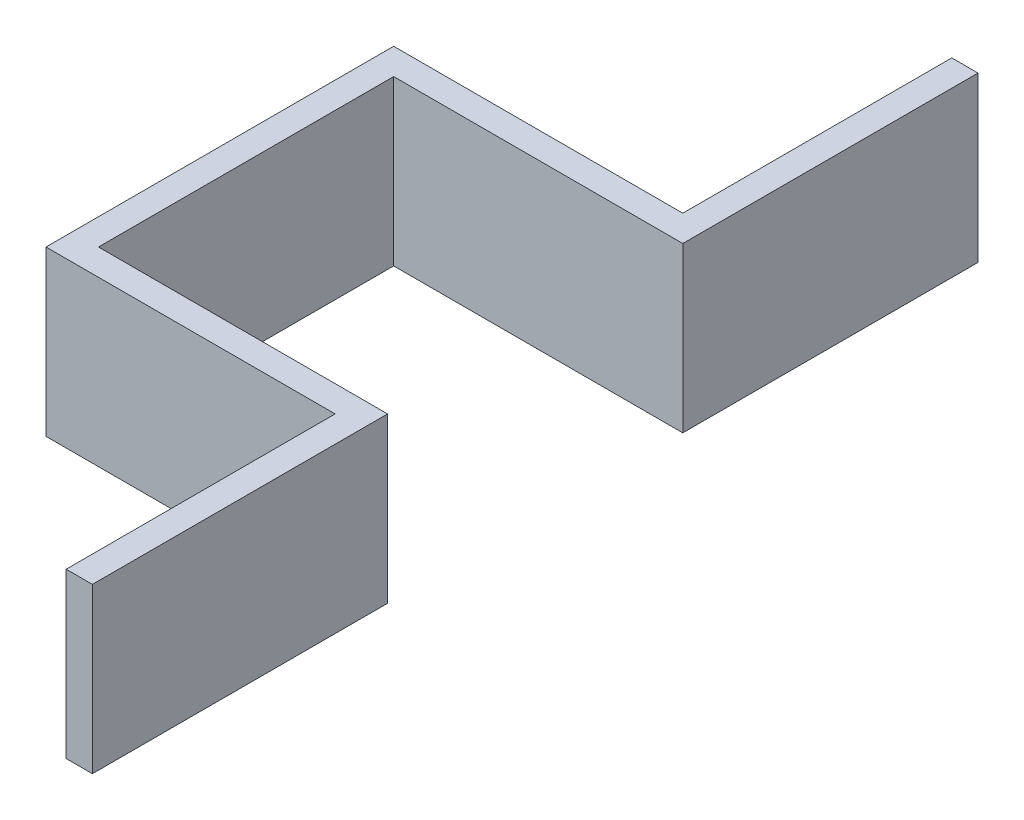
ISO-10303-21;
HEADER;
FILE_DESCRIPTION(('STEP AP214'),'2;1');
FILE_NAME('part.step','',(''),(''),'','','');
FILE_SCHEMA(('AUTOMOTIVE_DESIGN { 1 0 10303 214 1 1 1 1 }'));
ENDSEC;
DATA;
#1=APPLICATION_CONTEXT('core data for automotive mechanical design processes');
#2=APPLICATION_PROTOCOL_DEFINITION('international standard','automotive_design',2000,#1);
#3=PRODUCT_CONTEXT('',#1,'mechanical');
#4=PRODUCT('Part','Part','',(#3));
#5=PRODUCT_RELATED_PRODUCT_CATEGORY('part','',(#4));
#6=PRODUCT_DEFINITION_FORMATION('','',#4);
#7=PRODUCT_DEFINITION_CONTEXT('part definition',#1,'design');
#8=PRODUCT_DEFINITION('design','',#6,#7);
#9=PRODUCT_DEFINITION_SHAPE('','',#8);
#10=(LENGTH_UNIT() NAMED_UNIT(*) SI_UNIT(.MILLI.,.METRE.));
#11=(NAMED_UNIT(*) PLANE_ANGLE_UNIT() SI_UNIT($,.RADIAN.));
#12=(NAMED_UNIT(*) SI_UNIT($,.STERADIAN.) SOLID_ANGLE_UNIT());
#13=UNCERTAINTY_MEASURE_WITH_UNIT(LENGTH_MEASURE(1.E-05),#10,'distance_accuracy_value','');
#14=(GEOMETRIC_REPRESENTATION_CONTEXT(3) GLOBAL_UNCERTAINTY_ASSIGNED_CONTEXT((#13)) GLOBAL_UNIT_ASSIGNED_CONTEXT((#10,
#11,#12)) REPRESENTATION_CONTEXT('',''));
#15=CARTESIAN_POINT('',(0.,0.,0.));
#16=DIRECTION('',(0.,0.,1.));
#17=DIRECTION('',(1.,0.,0.));
#18=AXIS2_PLACEMENT_3D('',#15,#16,#17);
#19=CARTESIAN_POINT('',(-194.102258894868,-20.,-208.5));
#20=DIRECTION('',(-1.,0.,0.));
#21=DIRECTION('',(0.,0.,1.));
#22=AXIS2_PLACEMENT_3D('',#19,#20,#21);
#23=PLANE('',#22);
#24=DIRECTION('',(0.,0.,1.));
#25=VECTOR('',#24,1.);
#26=CARTESIAN_POINT('',(-194.102258894868,5.,-208.5));
#27=LINE('',#26,#25);
#28=CARTESIAN_POINT('',(-194.102258894868,5.,-208.5));
#29=VERTEX_POINT('',#28);
#30=CARTESIAN_POINT('',(-194.102258894868,5.,-167.5));
#31=VERTEX_POINT('',#30);
#32=EDGE_CURVE('E154',#29,#31,#27,.T.);
#33=ORIENTED_EDGE('',*,*,#32,.F.);
#34=DIRECTION('',(0.,1.,0.));
#35=VECTOR('',#34,1.);
#36=CARTESIAN_POINT('',(-194.102258894868,-20.,-208.5));
#37=LINE('',#36,#35);
#38=CARTESIAN_POINT('',(-194.102258894868,-20.,-208.5));
#39=VERTEX_POINT('',#38);
#40=EDGE_CURVE('E11',#39,#29,#37,.T.);
#41=ORIENTED_EDGE('',*,*,#40,.F.);
#42=DIRECTION('',(0.,0.,1.));
#43=VECTOR('',#42,1.);
#44=CARTESIAN_POINT('',(-194.102258894868,-20.,-208.5));
#45=LINE('',#44,#43);
#46=CARTESIAN_POINT('',(-194.102258894868,-20.,-167.5));
#47=VERTEX_POINT('',#46);
#48=EDGE_CURVE('E186',#39,#47,#45,.T.);
#49=ORIENTED_EDGE('',*,*,#48,.T.);
#50=DIRECTION('',(0.,1.,0.));
#51=VECTOR('',#50,1.);
#52=CARTESIAN_POINT('',(-194.102258894868,-20.,-167.5));
#53=LINE('',#52,#51);
#54=EDGE_CURVE('E36',#47,#31,#53,.T.);
#55=ORIENTED_EDGE('',*,*,#54,.T.);
#56=EDGE_LOOP('',(#33,#41,#49,#55));
#57=FACE_BOUND('',#56,.T.);
#58=ADVANCED_FACE('F33',(#57),#23,.T.);
#59=CARTESIAN_POINT('',(-238.174494692058,-20.,-208.5));
#60=DIRECTION('',(0.,0.,1.));
#61=DIRECTION('',(1.,0.,0.));
#62=AXIS2_PLACEMENT_3D('',#59,#60,#61);
#63=PLANE('',#62);
#64=DIRECTION('',(1.,0.,0.));
#65=VECTOR('',#64,1.);
#66=CARTESIAN_POINT('',(-238.174494692058,5.,-208.5));
#67=LINE('',#66,#65);
#68=CARTESIAN_POINT('',(-238.174494692058,5.,-208.5));
#69=VERTEX_POINT('',#68);
#70=EDGE_CURVE('E184',#69,#29,#67,.T.);
#71=ORIENTED_EDGE('',*,*,#70,.F.);
#72=DIRECTION('',(0.,1.,0.));
#73=VECTOR('',#72,1.);
#74=CARTESIAN_POINT('',(-238.174494692058,-20.,-208.5));
#75=LINE('',#74,#73);
#76=CARTESIAN_POINT('',(-238.174494692058,-20.,-208.5));
#77=VERTEX_POINT('',#76);
#78=EDGE_CURVE('E42',#77,#69,#75,.T.);
#79=ORIENTED_EDGE('',*,*,#78,.F.);
#80=DIRECTION('',(1.,0.,0.));
#81=VECTOR('',#80,1.);
#82=CARTESIAN_POINT('',(-238.174494692058,-20.,-208.5));
#83=LINE('',#82,#81);
#84=EDGE_CURVE('E144',#77,#39,#83,.T.);
#85=ORIENTED_EDGE('',*,*,#84,.T.);
#86=ORIENTED_EDGE('',*,*,#40,.T.);
#87=EDGE_LOOP('',(#71,#79,#85,#86));
#88=FACE_BOUND('',#87,.T.);
#89=ADVANCED_FACE('F206',(#88),#63,.T.);
#90=CARTESIAN_POINT('',(-238.174494692058,-20.,-261.5));
#91=DIRECTION('',(-1.,0.,0.));
#92=DIRECTION('',(0.,0.,1.));
#93=AXIS2_PLACEMENT_3D('',#90,#91,#92);
#94=PLANE('',#93);
#95=DIRECTION('',(0.,0.,1.));
#96=VECTOR('',#95,1.);
#97=CARTESIAN_POINT('',(-238.174494692058,5.,-261.5));
#98=LINE('',#97,#96);
#99=CARTESIAN_POINT('',(-238.174494692058,5.,-261.5));
#100=VERTEX_POINT('',#99);
#101=EDGE_CURVE('E131',#100,#69,#98,.T.);
#102=ORIENTED_EDGE('',*,*,#101,.F.);
#103=DIRECTION('',(0.,1.,0.));
#104=VECTOR('',#103,1.);
#105=CARTESIAN_POINT('',(-238.174494692058,-20.,-261.5));
#106=LINE('',#105,#104);
#107=CARTESIAN_POINT('',(-238.174494692058,-20.,-261.5));
#108=VERTEX_POINT('',#107);
#109=EDGE_CURVE('E126',#108,#100,#106,.T.);
#110=ORIENTED_EDGE('',*,*,#109,.F.);
#111=DIRECTION('',(0.,0.,1.));
#112=VECTOR('',#111,1.);
#113=CARTESIAN_POINT('',(-238.174494692058,-20.,-261.5));
#114=LINE('',#113,#112);
#115=EDGE_CURVE('E129',#108,#77,#114,.T.);
#116=ORIENTED_EDGE('',*,*,#115,.T.);
#117=ORIENTED_EDGE('',*,*,#78,.T.);
#118=EDGE_LOOP('',(#102,#110,#116,#117));
#119=FACE_BOUND('',#118,.T.);
#120=ADVANCED_FACE('F128',(#119),#94,.T.);
#121=CARTESIAN_POINT('',(-194.102258894868,-20.,-261.5));
#122=DIRECTION('',(0.,0.,-1.));
#123=DIRECTION('',(-1.,0.,0.));
#124=AXIS2_PLACEMENT_3D('',#121,#122,#123);
#125=PLANE('',#124);
#126=DIRECTION('',(-1.,0.,0.));
#127=VECTOR('',#126,1.);
#128=CARTESIAN_POINT('',(-194.102258894868,5.,-261.5));
#129=LINE('',#128,#127);
#130=CARTESIAN_POINT('',(-194.102258894868,5.,-261.5));
#131=VERTEX_POINT('',#130);
#132=EDGE_CURVE('E181',#131,#100,#129,.T.);
#133=ORIENTED_EDGE('',*,*,#132,.F.);
#134=DIRECTION('',(0.,1.,0.));
#135=VECTOR('',#134,1.);
#136=CARTESIAN_POINT('',(-194.102258894868,-20.,-261.5));
#137=LINE('',#136,#135);
#138=CARTESIAN_POINT('',(-194.102258894868,-20.,-261.5));
#139=VERTEX_POINT('',#138);
#140=EDGE_CURVE('E136',#139,#131,#137,.T.);
#141=ORIENTED_EDGE('',*,*,#140,.F.);
#142=DIRECTION('',(-1.,0.,0.));
#143=VECTOR('',#142,1.);
#144=CARTESIAN_POINT('',(-194.102258894868,-20.,-261.5));
#145=LINE('',#144,#143);
#146=EDGE_CURVE('E142',#139,#108,#145,.T.);
#147=ORIENTED_EDGE('',*,*,#146,.T.);
#148=ORIENTED_EDGE('',*,*,#109,.T.);
#149=EDGE_LOOP('',(#133,#141,#147,#148));
#150=FACE_BOUND('',#149,.T.);
#151=ADVANCED_FACE('F146',(#150),#125,.T.);
#152=CARTESIAN_POINT('',(-194.102258894868,-20.,-302.5));
#153=DIRECTION('',(-1.,0.,0.));
#154=DIRECTION('',(0.,0.,1.));
#155=AXIS2_PLACEMENT_3D('',#152,#153,#154);
#156=PLANE('',#155);
#157=DIRECTION('',(0.,0.,1.));
#158=VECTOR('',#157,1.);
#159=CARTESIAN_POINT('',(-194.102258894868,5.,-302.5));
#160=LINE('',#159,#158);
#161=CARTESIAN_POINT('',(-194.102258894868,5.,-302.5));
#162=VERTEX_POINT('',#161);
#163=EDGE_CURVE('E178',#162,#131,#160,.T.);
#164=ORIENTED_EDGE('',*,*,#163,.F.);
#165=DIRECTION('',(0.,1.,0.));
#166=VECTOR('',#165,1.);
#167=CARTESIAN_POINT('',(-194.102258894868,-20.,-302.5));
#168=LINE('',#167,#166);
#169=CARTESIAN_POINT('',(-194.102258894868,-20.,-302.5));
#170=VERTEX_POINT('',#169);
#171=EDGE_CURVE('E190',#170,#162,#168,.T.);
#172=ORIENTED_EDGE('',*,*,#171,.F.);
#173=DIRECTION('',(0.,0.,1.));
#174=VECTOR('',#173,1.);
#175=CARTESIAN_POINT('',(-194.102258894868,-20.,-302.5));
#176=LINE('',#175,#174);
#177=EDGE_CURVE('E147',#170,#139,#176,.T.);
#178=ORIENTED_EDGE('',*,*,#177,.T.);
#179=ORIENTED_EDGE('',*,*,#140,.T.);
#180=EDGE_LOOP('',(#164,#172,#178,#179));
#181=FACE_BOUND('',#180,.T.);
#182=ADVANCED_FACE('F219',(#181),#156,.T.);
#183=CARTESIAN_POINT('',(-190.102258894868,-20.,-302.5));
#184=DIRECTION('',(0.,0.,-1.));
#185=DIRECTION('',(-1.,0.,0.));
#186=AXIS2_PLACEMENT_3D('',#183,#184,#185);
#187=PLANE('',#186);
#188=DIRECTION('',(-1.,0.,0.));
#189=VECTOR('',#188,1.);
#190=CARTESIAN_POINT('',(-190.102258894868,5.,-302.5));
#191=LINE('',#190,#189);
#192=CARTESIAN_POINT('',(-190.102258894868,5.,-302.5));
#193=VERTEX_POINT('',#192);
#194=EDGE_CURVE('E175',#193,#162,#191,.T.);
#195=ORIENTED_EDGE('',*,*,#194,.F.);
#196=DIRECTION('',(0.,1.,0.));
#197=VECTOR('',#196,1.);
#198=CARTESIAN_POINT('',(-190.102258894868,-20.,-302.5));
#199=LINE('',#198,#197);
#200=CARTESIAN_POINT('',(-190.102258894868,-20.,-302.5));
#201=VERTEX_POINT('',#200);
#202=EDGE_CURVE('E192',#201,#193,#199,.T.);
#203=ORIENTED_EDGE('',*,*,#202,.F.);
#204=DIRECTION('',(-1.,0.,0.));
#205=VECTOR('',#204,1.);
#206=CARTESIAN_POINT('',(-190.102258894868,-20.,-302.5));
#207=LINE('',#206,#205);
#208=EDGE_CURVE('E149',#201,#170,#207,.T.);
#209=ORIENTED_EDGE('',*,*,#208,.T.);
#210=ORIENTED_EDGE('',*,*,#171,.T.);
#211=EDGE_LOOP('',(#195,#203,#209,#210));
#212=FACE_BOUND('',#211,.T.);
#213=ADVANCED_FACE('F222',(#212),#187,.T.);
#214=CARTESIAN_POINT('',(-190.102258894868,-20.,-257.5));
#215=DIRECTION('',(1.,0.,0.));
#216=DIRECTION('',(0.,0.,-1.));
#217=AXIS2_PLACEMENT_3D('',#214,#215,#216);
#218=PLANE('',#217);
#219=DIRECTION('',(0.,0.,-1.));
#220=VECTOR('',#219,1.);
#221=CARTESIAN_POINT('',(-190.102258894868,5.,-257.5));
#222=LINE('',#221,#220);
#223=CARTESIAN_POINT('',(-190.102258894868,5.,-257.5));
#224=VERTEX_POINT('',#223);
#225=EDGE_CURVE('E172',#224,#193,#222,.T.);
#226=ORIENTED_EDGE('',*,*,#225,.F.);
#227=DIRECTION('',(0.,1.,0.));
#228=VECTOR('',#227,1.);
#229=CARTESIAN_POINT('',(-190.102258894868,-20.,-257.5));
#230=LINE('',#229,#228);
#231=CARTESIAN_POINT('',(-190.102258894868,-20.,-257.5));
#232=VERTEX_POINT('',#231);
#233=EDGE_CURVE('E194',#232,#224,#230,.T.);
#234=ORIENTED_EDGE('',*,*,#233,.F.);
#235=DIRECTION('',(0.,0.,-1.));
#236=VECTOR('',#235,1.);
#237=CARTESIAN_POINT('',(-190.102258894868,-20.,-257.5));
#238=LINE('',#237,#236);
#239=EDGE_CURVE('E348',#232,#201,#238,.T.);
#240=ORIENTED_EDGE('',*,*,#239,.T.);
#241=ORIENTED_EDGE('',*,*,#202,.T.);
#242=EDGE_LOOP('',(#226,#234,#240,#241));
#243=FACE_BOUND('',#242,.T.);
#244=ADVANCED_FACE('F226',(#243),#218,.T.);
#245=CARTESIAN_POINT('',(-234.174494692058,-20.,-257.5));
#246=DIRECTION('',(0.,0.,1.));
#247=DIRECTION('',(1.,0.,0.));
#248=AXIS2_PLACEMENT_3D('',#245,#246,#247);
#249=PLANE('',#248);
#250=DIRECTION('',(1.,0.,0.));
#251=VECTOR('',#250,1.);
#252=CARTESIAN_POINT('',(-234.174494692058,5.,-257.5));
#253=LINE('',#252,#251);
#254=CARTESIAN_POINT('',(-234.174494692058,5.,-257.5));
#255=VERTEX_POINT('',#254);
#256=EDGE_CURVE('E169',#255,#224,#253,.T.);
#257=ORIENTED_EDGE('',*,*,#256,.F.);
#258=DIRECTION('',(0.,1.,0.));
#259=VECTOR('',#258,1.);
#260=CARTESIAN_POINT('',(-234.174494692058,-20.,-257.5));
#261=LINE('',#260,#259);
#262=CARTESIAN_POINT('',(-234.174494692058,-20.,-257.5));
#263=VERTEX_POINT('',#262);
#264=EDGE_CURVE('E196',#263,#255,#261,.T.);
#265=ORIENTED_EDGE('',*,*,#264,.F.);
#266=DIRECTION('',(1.,0.,0.));
#267=VECTOR('',#266,1.);
#268=CARTESIAN_POINT('',(-234.174494692058,-20.,-257.5));
#269=LINE('',#268,#267);
#270=EDGE_CURVE('E352',#263,#232,#269,.T.);
#271=ORIENTED_EDGE('',*,*,#270,.T.);
#272=ORIENTED_EDGE('',*,*,#233,.T.);
#273=EDGE_LOOP('',(#257,#265,#271,#272));
#274=FACE_BOUND('',#273,.T.);
#275=ADVANCED_FACE('F230',(#274),#249,.T.);
#276=CARTESIAN_POINT('',(-234.174494692058,-20.,-212.5));
#277=DIRECTION('',(1.,0.,0.));
#278=DIRECTION('',(0.,0.,-1.));
#279=AXIS2_PLACEMENT_3D('',#276,#277,#278);
#280=PLANE('',#279);
#281=DIRECTION('',(0.,0.,-1.));
#282=VECTOR('',#281,1.);
#283=CARTESIAN_POINT('',(-234.174494692058,5.,-212.5));
#284=LINE('',#283,#282);
#285=CARTESIAN_POINT('',(-234.174494692058,5.,-212.5));
#286=VERTEX_POINT('',#285);
#287=EDGE_CURVE('E166',#286,#255,#284,.T.);
#288=ORIENTED_EDGE('',*,*,#287,.F.);
#289=DIRECTION('',(0.,1.,0.));
#290=VECTOR('',#289,1.);
#291=CARTESIAN_POINT('',(-234.174494692058,-20.,-212.5));
#292=LINE('',#291,#290);
#293=CARTESIAN_POINT('',(-234.174494692058,-20.,-212.5));
#294=VERTEX_POINT('',#293);
#295=EDGE_CURVE('E198',#294,#286,#292,.T.);
#296=ORIENTED_EDGE('',*,*,#295,.F.);
#297=DIRECTION('',(0.,0.,-1.));
#298=VECTOR('',#297,1.);
#299=CARTESIAN_POINT('',(-234.174494692058,-20.,-212.5));
#300=LINE('',#299,#298);
#301=EDGE_CURVE('E341',#294,#263,#300,.T.);
#302=ORIENTED_EDGE('',*,*,#301,.T.);
#303=ORIENTED_EDGE('',*,*,#264,.T.);
#304=EDGE_LOOP('',(#288,#296,#302,#303));
#305=FACE_BOUND('',#304,.T.);
#306=ADVANCED_FACE('F234',(#305),#280,.T.);
#307=CARTESIAN_POINT('',(-190.102258894868,-20.,-212.5));
#308=DIRECTION('',(0.,0.,-1.));
#309=DIRECTION('',(-1.,0.,0.));
#310=AXIS2_PLACEMENT_3D('',#307,#308,#309);
#311=PLANE('',#310);
#312=DIRECTION('',(-1.,0.,0.));
#313=VECTOR('',#312,1.);
#314=CARTESIAN_POINT('',(-190.102258894868,5.,-212.5));
#315=LINE('',#314,#313);
#316=CARTESIAN_POINT('',(-190.102258894868,5.,-212.5));
#317=VERTEX_POINT('',#316);
#318=EDGE_CURVE('E163',#317,#286,#315,.T.);
#319=ORIENTED_EDGE('',*,*,#318,.F.);
#320=DIRECTION('',(0.,1.,0.));
#321=VECTOR('',#320,1.);
#322=CARTESIAN_POINT('',(-190.102258894868,-20.,-212.5));
#323=LINE('',#322,#321);
#324=CARTESIAN_POINT('',(-190.102258894868,-20.,-212.5));
#325=VERTEX_POINT('',#324);
#326=EDGE_CURVE('E200',#325,#317,#323,.T.);
#327=ORIENTED_EDGE('',*,*,#326,.F.);
#328=DIRECTION('',(-1.,0.,0.));
#329=VECTOR('',#328,1.);
#330=CARTESIAN_POINT('',(-190.102258894868,-20.,-212.5));
#331=LINE('',#330,#329);
#332=EDGE_CURVE('E337',#325,#294,#331,.T.);
#333=ORIENTED_EDGE('',*,*,#332,.T.);
#334=ORIENTED_EDGE('',*,*,#295,.T.);
#335=EDGE_LOOP('',(#319,#327,#333,#334));
#336=FACE_BOUND('',#335,.T.);
#337=ADVANCED_FACE('F238',(#336),#311,.T.);
#338=CARTESIAN_POINT('',(-190.102258894868,-20.,-167.5));
#339=DIRECTION('',(1.,0.,0.));
#340=DIRECTION('',(0.,0.,-1.));
#341=AXIS2_PLACEMENT_3D('',#338,#339,#340);
#342=PLANE('',#341);
#343=DIRECTION('',(0.,0.,-1.));
#344=VECTOR('',#343,1.);
#345=CARTESIAN_POINT('',(-190.102258894868,5.,-167.5));
#346=LINE('',#345,#344);
#347=CARTESIAN_POINT('',(-190.102258894868,5.,-167.5));
#348=VERTEX_POINT('',#347);
#349=EDGE_CURVE('E160',#348,#317,#346,.T.);
#350=ORIENTED_EDGE('',*,*,#349,.F.);
#351=DIRECTION('',(0.,1.,0.));
#352=VECTOR('',#351,1.);
#353=CARTESIAN_POINT('',(-190.102258894868,-20.,-167.5));
#354=LINE('',#353,#352);
#355=CARTESIAN_POINT('',(-190.102258894868,-20.,-167.5));
#356=VERTEX_POINT('',#355);
#357=EDGE_CURVE('E201',#356,#348,#354,.T.);
#358=ORIENTED_EDGE('',*,*,#357,.F.);
#359=DIRECTION('',(0.,0.,-1.));
#360=VECTOR('',#359,1.);
#361=CARTESIAN_POINT('',(-190.102258894868,-20.,-167.5));
#362=LINE('',#361,#360);
#363=EDGE_CURVE('E358',#356,#325,#362,.T.);
#364=ORIENTED_EDGE('',*,*,#363,.T.);
#365=ORIENTED_EDGE('',*,*,#326,.T.);
#366=EDGE_LOOP('',(#350,#358,#364,#365));
#367=FACE_BOUND('',#366,.T.);
#368=ADVANCED_FACE('F242',(#367),#342,.T.);
#369=CARTESIAN_POINT('',(-194.102258894868,-20.,-167.5));
#370=DIRECTION('',(0.,0.,1.));
#371=DIRECTION('',(1.,0.,0.));
#372=AXIS2_PLACEMENT_3D('',#369,#370,#371);
#373=PLANE('',#372);
#374=DIRECTION('',(1.,0.,0.));
#375=VECTOR('',#374,1.);
#376=CARTESIAN_POINT('',(-194.102258894868,5.,-167.5));
#377=LINE('',#376,#375);
#378=EDGE_CURVE('E157',#31,#348,#377,.T.);
#379=ORIENTED_EDGE('',*,*,#378,.F.);
#380=ORIENTED_EDGE('',*,*,#54,.F.);
#381=DIRECTION('',(1.,0.,0.));
#382=VECTOR('',#381,1.);
#383=CARTESIAN_POINT('',(-194.102258894868,-20.,-167.5));
#384=LINE('',#383,#382);
#385=EDGE_CURVE('E360',#47,#356,#384,.T.);
#386=ORIENTED_EDGE('',*,*,#385,.T.);
#387=ORIENTED_EDGE('',*,*,#357,.T.);
#388=EDGE_LOOP('',(#379,#380,#386,#387));
#389=FACE_BOUND('',#388,.T.);
#390=ADVANCED_FACE('F203',(#389),#373,.T.);
#391=CARTESIAN_POINT('',(0.,-20.,0.));
#392=DIRECTION('',(0.,1.,0.));
#393=DIRECTION('',(0.,0.,1.));
#394=AXIS2_PLACEMENT_3D('',#391,#392,#393);
#395=PLANE('',#394);
#396=ORIENTED_EDGE('',*,*,#48,.F.);
#397=ORIENTED_EDGE('',*,*,#84,.F.);
#398=ORIENTED_EDGE('',*,*,#115,.F.);
#399=ORIENTED_EDGE('',*,*,#146,.F.);
#400=ORIENTED_EDGE('',*,*,#177,.F.);
#401=ORIENTED_EDGE('',*,*,#208,.F.);
#402=ORIENTED_EDGE('',*,*,#239,.F.);
#403=ORIENTED_EDGE('',*,*,#270,.F.);
#404=ORIENTED_EDGE('',*,*,#301,.F.);
#405=ORIENTED_EDGE('',*,*,#332,.F.);
#406=ORIENTED_EDGE('',*,*,#363,.F.);
#407=ORIENTED_EDGE('',*,*,#385,.F.);
#408=EDGE_LOOP('',(#396,#397,#398,#399,#400,#401,#402,#403,#404,#405,#406,#407));
#409=FACE_BOUND('',#408,.T.);
#410=ADVANCED_FACE('F140',(#409),#395,.F.);
#411=CARTESIAN_POINT('',(0.,5.,0.));
#412=DIRECTION('',(0.,1.,0.));
#413=DIRECTION('',(0.,0.,1.));
#414=AXIS2_PLACEMENT_3D('',#411,#412,#413);
#415=PLANE('',#414);
#416=ORIENTED_EDGE('',*,*,#32,.T.);
#417=ORIENTED_EDGE('',*,*,#378,.T.);
#418=ORIENTED_EDGE('',*,*,#349,.T.);
#419=ORIENTED_EDGE('',*,*,#318,.T.);
#420=ORIENTED_EDGE('',*,*,#287,.T.);
#421=ORIENTED_EDGE('',*,*,#256,.T.);
#422=ORIENTED_EDGE('',*,*,#225,.T.);
#423=ORIENTED_EDGE('',*,*,#194,.T.);
#424=ORIENTED_EDGE('',*,*,#163,.T.);
#425=ORIENTED_EDGE('',*,*,#132,.T.);
#426=ORIENTED_EDGE('',*,*,#101,.T.);
#427=ORIENTED_EDGE('',*,*,#70,.T.);
#428=EDGE_LOOP('',(#416,#417,#418,#419,#420,#421,#422,#423,#424,#425,#426,#427));
#429=FACE_BOUND('',#428,.T.);
#430=ADVANCED_FACE('F205',(#429),#415,.T.);
#431=CLOSED_SHELL('',(#58,#89,#120,#151,#182,#213,#244,#275,#306,#337,#368,#390,#410,#430));
#432=MANIFOLD_SOLID_BREP('B2',#431);
#433=ADVANCED_BREP_SHAPE_REPRESENTATION('',(#18,#432),#14);
#434=SHAPE_DEFINITION_REPRESENTATION(#9,#433);
ENDSEC;
END-ISO-10303-21;
